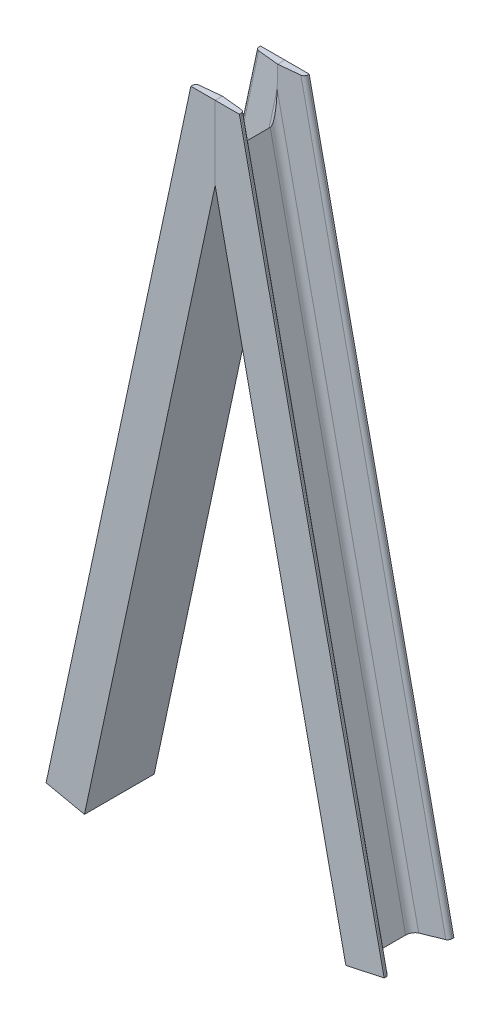
ISO-10303-21;
HEADER;
FILE_DESCRIPTION(('STEP AP214'),'2;1');
FILE_NAME('part.step','',(''),(''),'','','');
FILE_SCHEMA(('AUTOMOTIVE_DESIGN { 1 0 10303 214 1 1 1 1 }'));
ENDSEC;
DATA;
#1=APPLICATION_CONTEXT('core data for automotive mechanical design processes');
#2=APPLICATION_PROTOCOL_DEFINITION('international standard','automotive_design',2000,#1);
#3=PRODUCT_CONTEXT('',#1,'mechanical');
#4=PRODUCT('Part','Part','',(#3));
#5=PRODUCT_RELATED_PRODUCT_CATEGORY('part','',(#4));
#6=PRODUCT_DEFINITION_FORMATION('','',#4);
#7=PRODUCT_DEFINITION_CONTEXT('part definition',#1,'design');
#8=PRODUCT_DEFINITION('design','',#6,#7);
#9=PRODUCT_DEFINITION_SHAPE('','',#8);
#10=(LENGTH_UNIT() NAMED_UNIT(*) SI_UNIT(.MILLI.,.METRE.));
#11=(NAMED_UNIT(*) PLANE_ANGLE_UNIT() SI_UNIT($,.RADIAN.));
#12=(NAMED_UNIT(*) SI_UNIT($,.STERADIAN.) SOLID_ANGLE_UNIT());
#13=UNCERTAINTY_MEASURE_WITH_UNIT(LENGTH_MEASURE(1.E-05),#10,'distance_accuracy_value','');
#14=(GEOMETRIC_REPRESENTATION_CONTEXT(3) GLOBAL_UNCERTAINTY_ASSIGNED_CONTEXT((#13)) GLOBAL_UNIT_ASSIGNED_CONTEXT((#10,
#11,#12)) REPRESENTATION_CONTEXT('',''));
#15=CARTESIAN_POINT('',(0.,0.,0.));
#16=DIRECTION('',(0.,0.,1.));
#17=DIRECTION('',(1.,0.,0.));
#18=AXIS2_PLACEMENT_3D('',#15,#16,#17);
#19=CARTESIAN_POINT('',(-40.0898989771738,708.590692637966,78.1774248245681));
#20=DIRECTION('',(-0.209529088730874,-0.97780241407741,0.));
#21=DIRECTION('',(0.97780241407741,-0.209529088730874,0.));
#22=AXIS2_PLACEMENT_3D('',#19,#20,#21);
#23=CYLINDRICAL_SURFACE('',#22,4.);
#24=DIRECTION('',(-0.209529088730874,-0.97780241407741,0.));
#25=VECTOR('',#24,1.);
#26=CARTESIAN_POINT('',(-44.0011086334834,709.428808992889,78.1774248245681));
#27=LINE('',#26,#25);
#28=CARTESIAN_POINT('',(-27.8571428571429,784.767315949145,78.1774248245681));
#29=VERTEX_POINT('',#28);
#30=CARTESIAN_POINT('',(-194.001108633483,9.42880899288912,78.1774248245681));
#31=VERTEX_POINT('',#30);
#32=EDGE_CURVE('E218',#29,#31,#27,.T.);
#33=ORIENTED_EDGE('',*,*,#32,.F.);
#34=CARTESIAN_POINT('',(-23.7663368390639,784.767315949145,78.1774248245681));
#35=DIRECTION('',(0.,-1.,0.));
#36=DIRECTION('',(-1.,0.,0.));
#37=AXIS2_PLACEMENT_3D('',#34,#35,#36);
#38=ELLIPSE('',#37,4.09080601807896,4.);
#39=CARTESIAN_POINT('',(-24.1939425056598,784.767315949145,74.199337243095));
#40=VERTEX_POINT('',#39);
#41=EDGE_CURVE('E258',#29,#40,#38,.T.);
#42=ORIENTED_EDGE('',*,*,#41,.T.);
#43=DIRECTION('',(-0.209529088730874,-0.97780241407741,0.));
#44=VECTOR('',#43,1.);
#45=CARTESIAN_POINT('',(-40.4987317120654,708.678299652586,74.199337243095));
#46=LINE('',#45,#44);
#47=CARTESIAN_POINT('',(-190.498731712065,8.67829965258532,74.199337243095));
#48=VERTEX_POINT('',#47);
#49=EDGE_CURVE('E249',#40,#48,#46,.T.);
#50=ORIENTED_EDGE('',*,*,#49,.T.);
#51=CARTESIAN_POINT('',(-190.089898977174,8.59069263796563,78.1774248245681));
#52=DIRECTION('',(0.209529088730874,0.97780241407741,0.));
#53=DIRECTION('',(-0.97780241407741,0.209529088730874,0.));
#54=AXIS2_PLACEMENT_3D('',#51,#52,#53);
#55=CIRCLE('',#54,4.);
#56=EDGE_CURVE('E221',#48,#31,#55,.T.);
#57=ORIENTED_EDGE('',*,*,#56,.T.);
#58=EDGE_LOOP('',(#33,#42,#50,#57));
#59=FACE_BOUND('',#58,.T.);
#60=ADVANCED_FACE('F89',(#59),#23,.T.);
#61=CARTESIAN_POINT('',(-44.0011086334834,709.428808992889,80.));
#62=DIRECTION('',(0.97780241407741,-0.209529088730874,0.));
#63=DIRECTION('',(0.209529088730874,0.97780241407741,0.));
#64=AXIS2_PLACEMENT_3D('',#61,#62,#63);
#65=PLANE('',#64);
#66=DIRECTION('',(-0.209529088730874,-0.97780241407741,0.));
#67=VECTOR('',#66,1.);
#68=CARTESIAN_POINT('',(-44.0011086334834,709.428808992889,80.));
#69=LINE('',#68,#67);
#70=CARTESIAN_POINT('',(-27.8571428571429,784.767315949145,80.));
#71=VERTEX_POINT('',#70);
#72=CARTESIAN_POINT('',(-194.001108633483,9.42880899288912,80.));
#73=VERTEX_POINT('',#72);
#74=EDGE_CURVE('E222',#71,#73,#69,.T.);
#75=ORIENTED_EDGE('',*,*,#74,.F.);
#76=DIRECTION('',(0.,0.,-1.));
#77=VECTOR('',#76,1.);
#78=CARTESIAN_POINT('',(-27.8571428571429,784.767315949145,80.0000000000003));
#79=LINE('',#78,#77);
#80=EDGE_CURVE('E250',#71,#29,#79,.T.);
#81=ORIENTED_EDGE('',*,*,#80,.T.);
#82=ORIENTED_EDGE('',*,*,#32,.T.);
#83=DIRECTION('',(0.,0.,1.));
#84=VECTOR('',#83,1.);
#85=CARTESIAN_POINT('',(-194.001108633483,9.42880899288912,80.));
#86=LINE('',#85,#84);
#87=EDGE_CURVE('E220',#31,#73,#86,.T.);
#88=ORIENTED_EDGE('',*,*,#87,.T.);
#89=EDGE_LOOP('',(#75,#81,#82,#88));
#90=FACE_BOUND('',#89,.T.);
#91=ADVANCED_FACE('F329',(#90),#65,.F.);
#92=CARTESIAN_POINT('',(-44.0011086334834,709.428808992889,80.));
#93=DIRECTION('',(0.,0.,-1.));
#94=DIRECTION('',(-1.,0.,0.));
#95=AXIS2_PLACEMENT_3D('',#92,#93,#94);
#96=PLANE('',#95);
#97=DIRECTION('',(0.,-1.,0.));
#98=VECTOR('',#97,1.);
#99=CARTESIAN_POINT('',(0.,709.428808992889,80.));
#100=LINE('',#99,#98);
#101=CARTESIAN_POINT('',(0.,784.767315949145,80.));
#102=VERTEX_POINT('',#101);
#103=CARTESIAN_POINT('',(0.,700.,80.));
#104=VERTEX_POINT('',#103);
#105=EDGE_CURVE('E209',#102,#104,#100,.T.);
#106=ORIENTED_EDGE('',*,*,#105,.F.);
#107=DIRECTION('',(-1.,0.,0.));
#108=VECTOR('',#107,1.);
#109=CARTESIAN_POINT('',(121.963922393269,784.767315949145,80.));
#110=LINE('',#109,#108);
#111=EDGE_CURVE('E111',#102,#71,#110,.T.);
#112=ORIENTED_EDGE('',*,*,#111,.T.);
#113=ORIENTED_EDGE('',*,*,#74,.T.);
#114=DIRECTION('',(0.97780241407741,-0.209529088730874,0.));
#115=VECTOR('',#114,1.);
#116=CARTESIAN_POINT('',(-194.001108633483,9.42880899288912,80.));
#117=LINE('',#116,#115);
#118=CARTESIAN_POINT('',(-150.,-1.11022302462516E-13,80.));
#119=VERTEX_POINT('',#118);
#120=EDGE_CURVE('E224',#73,#119,#117,.T.);
#121=ORIENTED_EDGE('',*,*,#120,.T.);
#122=DIRECTION('',(-0.209529088730874,-0.97780241407741,0.));
#123=VECTOR('',#122,1.);
#124=CARTESIAN_POINT('',(0.,700.,80.));
#125=LINE('',#124,#123);
#126=EDGE_CURVE('E225',#104,#119,#125,.T.);
#127=ORIENTED_EDGE('',*,*,#126,.F.);
#128=EDGE_LOOP('',(#106,#112,#113,#121,#127));
#129=FACE_BOUND('',#128,.T.);
#130=ADVANCED_FACE('F327',(#129),#96,.F.);
#131=CARTESIAN_POINT('',(0.,700.,80.));
#132=DIRECTION('',(-0.97780241407741,0.209529088730874,0.));
#133=DIRECTION('',(-0.209529088730874,-0.97780241407741,0.));
#134=AXIS2_PLACEMENT_3D('',#131,#132,#133);
#135=PLANE('',#134);
#136=DIRECTION('',(0.,0.,-1.));
#137=VECTOR('',#136,1.);
#138=CARTESIAN_POINT('',(0.,700.,80.));
#139=LINE('',#138,#137);
#140=CARTESIAN_POINT('',(0.,700.,0.));
#141=VERTEX_POINT('',#140);
#142=EDGE_CURVE('E204',#104,#141,#139,.T.);
#143=ORIENTED_EDGE('',*,*,#142,.F.);
#144=ORIENTED_EDGE('',*,*,#126,.T.);
#145=DIRECTION('',(0.,0.,-1.));
#146=VECTOR('',#145,1.);
#147=CARTESIAN_POINT('',(-150.,-1.11022302462516E-13,80.));
#148=LINE('',#147,#146);
#149=CARTESIAN_POINT('',(-150.,-1.66533453693773E-13,0.));
#150=VERTEX_POINT('',#149);
#151=EDGE_CURVE('E227',#119,#150,#148,.T.);
#152=ORIENTED_EDGE('',*,*,#151,.T.);
#153=DIRECTION('',(-0.209529088730874,-0.97780241407741,0.));
#154=VECTOR('',#153,1.);
#155=CARTESIAN_POINT('',(0.,700.,0.));
#156=LINE('',#155,#154);
#157=EDGE_CURVE('E228',#141,#150,#156,.T.);
#158=ORIENTED_EDGE('',*,*,#157,.F.);
#159=EDGE_LOOP('',(#143,#144,#152,#158));
#160=FACE_BOUND('',#159,.T.);
#161=ADVANCED_FACE('F335',(#160),#135,.F.);
#162=CARTESIAN_POINT('',(-44.0011086334834,709.428808992889,0.));
#163=DIRECTION('',(0.,0.,1.));
#164=DIRECTION('',(1.,0.,0.));
#165=AXIS2_PLACEMENT_3D('',#162,#163,#164);
#166=PLANE('',#165);
#167=DIRECTION('',(-0.209529088730874,-0.97780241407741,0.));
#168=VECTOR('',#167,1.);
#169=CARTESIAN_POINT('',(-44.0011086334834,709.428808992889,0.));
#170=LINE('',#169,#168);
#171=CARTESIAN_POINT('',(-27.8571428571428,784.767315949145,0.));
#172=VERTEX_POINT('',#171);
#173=CARTESIAN_POINT('',(-194.001108633483,9.42880899288912,0.));
#174=VERTEX_POINT('',#173);
#175=EDGE_CURVE('E200',#172,#174,#170,.T.);
#176=ORIENTED_EDGE('',*,*,#175,.F.);
#177=DIRECTION('',(-1.,0.,0.));
#178=VECTOR('',#177,1.);
#179=CARTESIAN_POINT('',(121.963922393269,784.767315949145,0.));
#180=LINE('',#179,#178);
#181=CARTESIAN_POINT('',(0.,784.767315949145,0.));
#182=VERTEX_POINT('',#181);
#183=EDGE_CURVE('E188',#182,#172,#180,.T.);
#184=ORIENTED_EDGE('',*,*,#183,.F.);
#185=DIRECTION('',(0.,1.,0.));
#186=VECTOR('',#185,1.);
#187=CARTESIAN_POINT('',(0.,709.428808992889,0.));
#188=LINE('',#187,#186);
#189=EDGE_CURVE('E197',#141,#182,#188,.T.);
#190=ORIENTED_EDGE('',*,*,#189,.F.);
#191=ORIENTED_EDGE('',*,*,#157,.T.);
#192=DIRECTION('',(-0.97780241407741,0.209529088730874,0.));
#193=VECTOR('',#192,1.);
#194=CARTESIAN_POINT('',(-194.001108633483,9.42880899288912,0.));
#195=LINE('',#194,#193);
#196=EDGE_CURVE('E230',#150,#174,#195,.T.);
#197=ORIENTED_EDGE('',*,*,#196,.T.);
#198=EDGE_LOOP('',(#176,#184,#190,#191,#197));
#199=FACE_BOUND('',#198,.T.);
#200=ADVANCED_FACE('F196',(#199),#166,.F.);
#201=CARTESIAN_POINT('',(-44.0011086334834,709.428808992889,0.));
#202=DIRECTION('',(0.97780241407741,-0.209529088730874,0.));
#203=DIRECTION('',(0.209529088730874,0.97780241407741,0.));
#204=AXIS2_PLACEMENT_3D('',#201,#202,#203);
#205=PLANE('',#204);
#206=DIRECTION('',(-0.209529088730874,-0.97780241407741,0.));
#207=VECTOR('',#206,1.);
#208=CARTESIAN_POINT('',(-44.0011086334834,709.428808992889,1.82257517543191));
#209=LINE('',#208,#207);
#210=CARTESIAN_POINT('',(-27.8571428571429,784.767315949145,1.82257517543191));
#211=VERTEX_POINT('',#210);
#212=CARTESIAN_POINT('',(-194.001108633483,9.42880899288923,1.8225751754319));
#213=VERTEX_POINT('',#212);
#214=EDGE_CURVE('E233',#211,#213,#209,.T.);
#215=ORIENTED_EDGE('',*,*,#214,.F.);
#216=DIRECTION('',(0.,0.,-1.));
#217=VECTOR('',#216,1.);
#218=CARTESIAN_POINT('',(-27.8571428571429,784.767315949145,2.4980018054066E-13));
#219=LINE('',#218,#217);
#220=EDGE_CURVE('E319',#211,#172,#219,.T.);
#221=ORIENTED_EDGE('',*,*,#220,.T.);
#222=ORIENTED_EDGE('',*,*,#175,.T.);
#223=DIRECTION('',(0.,0.,1.));
#224=VECTOR('',#223,1.);
#225=CARTESIAN_POINT('',(-194.001108633483,9.42880899288912,0.));
#226=LINE('',#225,#224);
#227=EDGE_CURVE('E232',#174,#213,#226,.T.);
#228=ORIENTED_EDGE('',*,*,#227,.T.);
#229=EDGE_LOOP('',(#215,#221,#222,#228));
#230=FACE_BOUND('',#229,.T.);
#231=ADVANCED_FACE('F339',(#230),#205,.F.);
#232=CARTESIAN_POINT('',(-40.0898989771738,708.590692637966,1.82257517543191));
#233=DIRECTION('',(-0.209529088730874,-0.97780241407741,0.));
#234=DIRECTION('',(0.97780241407741,-0.209529088730874,0.));
#235=AXIS2_PLACEMENT_3D('',#232,#233,#234);
#236=CYLINDRICAL_SURFACE('',#235,4.00000000000002);
#237=DIRECTION('',(-0.209529088730874,-0.97780241407741,0.));
#238=VECTOR('',#237,1.);
#239=CARTESIAN_POINT('',(-40.4987317120654,708.678299652586,5.80066275690501));
#240=LINE('',#239,#238);
#241=CARTESIAN_POINT('',(-24.1939425056598,784.767315949145,5.80066275690499));
#242=VERTEX_POINT('',#241);
#243=CARTESIAN_POINT('',(-190.498731712066,8.67829965258532,5.80066275690501));
#244=VERTEX_POINT('',#243);
#245=EDGE_CURVE('E236',#242,#244,#240,.T.);
#246=ORIENTED_EDGE('',*,*,#245,.F.);
#247=CARTESIAN_POINT('',(-23.7663368390639,784.767315949145,1.82257517543191));
#248=DIRECTION('',(0.,-1.,0.));
#249=DIRECTION('',(-1.,0.,0.));
#250=AXIS2_PLACEMENT_3D('',#247,#248,#249);
#251=ELLIPSE('',#250,4.09080601807898,4.00000000000002);
#252=EDGE_CURVE('E320',#242,#211,#251,.T.);
#253=ORIENTED_EDGE('',*,*,#252,.T.);
#254=ORIENTED_EDGE('',*,*,#214,.T.);
#255=CARTESIAN_POINT('',(-190.089898977174,8.59069263796563,1.82257517543191));
#256=DIRECTION('',(0.209529088730874,0.97780241407741,0.));
#257=DIRECTION('',(0.97780241407741,-0.209529088730874,0.));
#258=AXIS2_PLACEMENT_3D('',#255,#256,#257);
#259=CIRCLE('',#258,4.00000000000002);
#260=EDGE_CURVE('E235',#213,#244,#259,.T.);
#261=ORIENTED_EDGE('',*,*,#260,.T.);
#262=EDGE_LOOP('',(#246,#253,#254,#261));
#263=FACE_BOUND('',#262,.T.);
#264=ADVANCED_FACE('F341',(#263),#236,.T.);
#265=CARTESIAN_POINT('',(-12.3826671202617,702.653428668628,8.82286583705383));
#266=DIRECTION('',(0.102208183722907,-0.0219017536549087,-0.994521895368274));
#267=DIRECTION('',(-0.994760510736495,0.,-0.102232706504666));
#268=AXIS2_PLACEMENT_3D('',#265,#266,#267);
#269=PLANE('',#268);
#270=DIRECTION('',(0.,-0.999757595235828,0.0220170563035927));
#271=VECTOR('',#270,1.);
#272=CARTESIAN_POINT('',(0.,702.681440369827,10.0948302015586));
#273=LINE('',#272,#271);
#274=CARTESIAN_POINT('',(0.,784.767315949145,8.28710265542954));
#275=VERTEX_POINT('',#274);
#276=CARTESIAN_POINT('',(0.,760.439208563183,8.82286583705381));
#277=VERTEX_POINT('',#276);
#278=EDGE_CURVE('E205',#275,#277,#273,.T.);
#279=ORIENTED_EDGE('',*,*,#278,.F.);
#280=DIRECTION('',(-0.994760510736494,0.,-0.102232706504666));
#281=VECTOR('',#280,1.);
#282=CARTESIAN_POINT('',(-12.1987638093749,784.767315949145,7.03342136552768));
#283=LINE('',#282,#281);
#284=EDGE_CURVE('E104',#275,#242,#283,.T.);
#285=ORIENTED_EDGE('',*,*,#284,.T.);
#286=ORIENTED_EDGE('',*,*,#245,.T.);
#287=DIRECTION('',(0.97244591014394,-0.208381266459416,0.104528463267647));
#288=VECTOR('',#287,1.);
#289=CARTESIAN_POINT('',(-162.382667120262,2.65342866862733,8.82286583705383));
#290=LINE('',#289,#288);
#291=CARTESIAN_POINT('',(-162.382667120262,2.65342866862733,8.82286583705382));
#292=VERTEX_POINT('',#291);
#293=EDGE_CURVE('E238',#244,#292,#290,.T.);
#294=ORIENTED_EDGE('',*,*,#293,.T.);
#295=DIRECTION('',(-0.209529088730874,-0.97780241407741,0.));
#296=VECTOR('',#295,1.);
#297=CARTESIAN_POINT('',(-12.3826671202617,702.653428668628,8.82286583705382));
#298=LINE('',#297,#296);
#299=EDGE_CURVE('E239',#277,#292,#298,.T.);
#300=ORIENTED_EDGE('',*,*,#299,.F.);
#301=EDGE_LOOP('',(#279,#285,#286,#294,#300));
#302=FACE_BOUND('',#301,.T.);
#303=ADVANCED_FACE('F298',(#302),#269,.F.);
#304=CARTESIAN_POINT('',(-13.2003325900451,702.828642697867,16.779041));
#305=DIRECTION('',(-0.209529088730874,-0.97780241407741,0.));
#306=DIRECTION('',(0.97780241407741,-0.209529088730874,0.));
#307=AXIS2_PLACEMENT_3D('',#304,#305,#306);
#308=CYLINDRICAL_SURFACE('',#307,8.00000000000001);
#309=CARTESIAN_POINT('',(0.,764.430194784744,16.779041));
#310=DIRECTION('',(1.,0.,0.));
#311=DIRECTION('',(0.,-1.,0.));
#312=AXIS2_PLACEMENT_3D('',#309,#310,#311);
#313=ELLIPSE('',#312,38.180856168737,8.00000000000001);
#314=CARTESIAN_POINT('',(0.,726.249338616007,16.779041));
#315=VERTEX_POINT('',#314);
#316=EDGE_CURVE('E207',#277,#315,#313,.F.);
#317=ORIENTED_EDGE('',*,*,#316,.F.);
#318=ORIENTED_EDGE('',*,*,#299,.T.);
#319=CARTESIAN_POINT('',(-163.200332590045,2.8286426978667,16.779041));
#320=DIRECTION('',(-0.209529088730874,-0.97780241407741,0.));
#321=DIRECTION('',(-0.97780241407741,0.209529088730874,0.));
#322=AXIS2_PLACEMENT_3D('',#319,#320,#321);
#323=CIRCLE('',#322,8.00000000000001);
#324=CARTESIAN_POINT('',(-155.377913277426,1.15240998801958,16.779041));
#325=VERTEX_POINT('',#324);
#326=EDGE_CURVE('E241',#292,#325,#323,.T.);
#327=ORIENTED_EDGE('',*,*,#326,.T.);
#328=DIRECTION('',(-0.209529088730874,-0.97780241407741,0.));
#329=VECTOR('',#328,1.);
#330=CARTESIAN_POINT('',(-5.37791327742576,701.15240998802,16.779041));
#331=LINE('',#330,#329);
#332=EDGE_CURVE('E242',#315,#325,#331,.T.);
#333=ORIENTED_EDGE('',*,*,#332,.F.);
#334=EDGE_LOOP('',(#317,#318,#327,#333));
#335=FACE_BOUND('',#334,.T.);
#336=ADVANCED_FACE('F296',(#335),#308,.F.);
#337=CARTESIAN_POINT('',(-5.37791327742575,701.15240998802,63.220959));
#338=DIRECTION('',(0.97780241407741,-0.209529088730874,0.));
#339=DIRECTION('',(0.209529088730874,0.97780241407741,0.));
#340=AXIS2_PLACEMENT_3D('',#337,#338,#339);
#341=PLANE('',#340);
#342=DIRECTION('',(0.,0.,1.));
#343=VECTOR('',#342,1.);
#344=CARTESIAN_POINT('',(0.,726.249338616007,63.220959));
#345=LINE('',#344,#343);
#346=CARTESIAN_POINT('',(0.,726.249338616007,63.220959));
#347=VERTEX_POINT('',#346);
#348=EDGE_CURVE('E289',#315,#347,#345,.T.);
#349=ORIENTED_EDGE('',*,*,#348,.F.);
#350=ORIENTED_EDGE('',*,*,#332,.T.);
#351=DIRECTION('',(0.,0.,1.));
#352=VECTOR('',#351,1.);
#353=CARTESIAN_POINT('',(-155.377913277426,1.15240998801963,63.220959));
#354=LINE('',#353,#352);
#355=CARTESIAN_POINT('',(-155.377913277426,1.15240998801963,63.220959));
#356=VERTEX_POINT('',#355);
#357=EDGE_CURVE('E244',#325,#356,#354,.T.);
#358=ORIENTED_EDGE('',*,*,#357,.T.);
#359=DIRECTION('',(-0.209529088730874,-0.97780241407741,0.));
#360=VECTOR('',#359,1.);
#361=CARTESIAN_POINT('',(-5.37791327742575,701.15240998802,63.220959));
#362=LINE('',#361,#360);
#363=EDGE_CURVE('E245',#347,#356,#362,.T.);
#364=ORIENTED_EDGE('',*,*,#363,.F.);
#365=EDGE_LOOP('',(#349,#350,#358,#364));
#366=FACE_BOUND('',#365,.T.);
#367=ADVANCED_FACE('F311',(#366),#341,.F.);
#368=CARTESIAN_POINT('',(-13.200332590045,702.828642697867,63.220959));
#369=DIRECTION('',(-0.209529088730874,-0.97780241407741,0.));
#370=DIRECTION('',(0.97780241407741,-0.209529088730874,0.));
#371=AXIS2_PLACEMENT_3D('',#368,#369,#370);
#372=CYLINDRICAL_SURFACE('',#371,7.99999999999999);
#373=CARTESIAN_POINT('',(0.,764.430194784744,63.220959));
#374=DIRECTION('',(1.,0.,0.));
#375=DIRECTION('',(0.,-1.,0.));
#376=AXIS2_PLACEMENT_3D('',#373,#374,#375);
#377=ELLIPSE('',#376,38.1808561687369,7.99999999999999);
#378=CARTESIAN_POINT('',(0.,760.439208563183,71.1771341629462));
#379=VERTEX_POINT('',#378);
#380=EDGE_CURVE('E193',#347,#379,#377,.F.);
#381=ORIENTED_EDGE('',*,*,#380,.F.);
#382=ORIENTED_EDGE('',*,*,#363,.T.);
#383=CARTESIAN_POINT('',(-163.200332590045,2.82864269786665,63.220959));
#384=DIRECTION('',(-0.209529088730874,-0.97780241407741,0.));
#385=DIRECTION('',(0.97780241407741,-0.209529088730874,0.));
#386=AXIS2_PLACEMENT_3D('',#383,#384,#385);
#387=CIRCLE('',#386,7.99999999999999);
#388=CARTESIAN_POINT('',(-162.382667120262,2.65342866862739,71.1771341629462));
#389=VERTEX_POINT('',#388);
#390=EDGE_CURVE('E247',#356,#389,#387,.T.);
#391=ORIENTED_EDGE('',*,*,#390,.T.);
#392=DIRECTION('',(-0.209529088730874,-0.97780241407741,0.));
#393=VECTOR('',#392,1.);
#394=CARTESIAN_POINT('',(-12.3826671202617,702.653428668628,71.1771341629462));
#395=LINE('',#394,#393);
#396=EDGE_CURVE('E248',#379,#389,#395,.T.);
#397=ORIENTED_EDGE('',*,*,#396,.F.);
#398=EDGE_LOOP('',(#381,#382,#391,#397));
#399=FACE_BOUND('',#398,.T.);
#400=ADVANCED_FACE('F313',(#399),#372,.F.);
#401=CARTESIAN_POINT('',(-12.3826671202617,702.653428668628,71.1771341629462));
#402=DIRECTION('',(0.102208183722907,-0.0219017536549087,0.994521895368274));
#403=DIRECTION('',(0.994760510736495,0.,-0.102232706504666));
#404=AXIS2_PLACEMENT_3D('',#401,#402,#403);
#405=PLANE('',#404);
#406=ORIENTED_EDGE('',*,*,#49,.F.);
#407=DIRECTION('',(0.994760510736494,0.,-0.102232706504666));
#408=VECTOR('',#407,1.);
#409=CARTESIAN_POINT('',(-12.1987638093749,784.767315949145,72.9665786344723));
#410=LINE('',#409,#408);
#411=CARTESIAN_POINT('',(0.,784.767315949145,71.7128973445705));
#412=VERTEX_POINT('',#411);
#413=EDGE_CURVE('E263',#40,#412,#410,.T.);
#414=ORIENTED_EDGE('',*,*,#413,.T.);
#415=DIRECTION('',(0.,0.999757595235828,0.0220170563035926));
#416=VECTOR('',#415,1.);
#417=CARTESIAN_POINT('',(0.,702.681440369827,69.9051697984414));
#418=LINE('',#417,#416);
#419=EDGE_CURVE('E214',#379,#412,#418,.T.);
#420=ORIENTED_EDGE('',*,*,#419,.F.);
#421=ORIENTED_EDGE('',*,*,#396,.T.);
#422=DIRECTION('',(-0.97244591014394,0.208381266459416,0.104528463267647));
#423=VECTOR('',#422,1.);
#424=CARTESIAN_POINT('',(-162.382667120262,2.65342866862739,71.1771341629462));
#425=LINE('',#424,#423);
#426=EDGE_CURVE('E217',#389,#48,#425,.T.);
#427=ORIENTED_EDGE('',*,*,#426,.T.);
#428=EDGE_LOOP('',(#406,#414,#420,#421,#427));
#429=FACE_BOUND('',#428,.T.);
#430=ADVANCED_FACE('F318',(#429),#405,.F.);
#431=CARTESIAN_POINT('',(-190.089898977174,8.59069263796563,78.1774248245681));
#432=DIRECTION('',(0.209529088730874,0.97780241407741,0.));
#433=DIRECTION('',(-0.97780241407741,0.209529088730874,0.));
#434=AXIS2_PLACEMENT_3D('',#431,#432,#433);
#435=PLANE('',#434);
#436=ORIENTED_EDGE('',*,*,#56,.F.);
#437=ORIENTED_EDGE('',*,*,#426,.F.);
#438=ORIENTED_EDGE('',*,*,#390,.F.);
#439=ORIENTED_EDGE('',*,*,#357,.F.);
#440=ORIENTED_EDGE('',*,*,#326,.F.);
#441=ORIENTED_EDGE('',*,*,#293,.F.);
#442=ORIENTED_EDGE('',*,*,#260,.F.);
#443=ORIENTED_EDGE('',*,*,#227,.F.);
#444=ORIENTED_EDGE('',*,*,#196,.F.);
#445=ORIENTED_EDGE('',*,*,#151,.F.);
#446=ORIENTED_EDGE('',*,*,#120,.F.);
#447=ORIENTED_EDGE('',*,*,#87,.F.);
#448=EDGE_LOOP('',(#436,#437,#438,#439,#440,#441,#442,#443,#444,#445,#446,#447));
#449=FACE_BOUND('',#448,.T.);
#450=ADVANCED_FACE('F306',(#449),#435,.F.);
#451=CARTESIAN_POINT('',(0.,700.,0.));
#452=DIRECTION('',(1.,0.,0.));
#453=DIRECTION('',(0.,0.,-1.));
#454=AXIS2_PLACEMENT_3D('',#451,#452,#453);
#455=PLANE('',#454);
#456=DIRECTION('',(0.,0.,-1.));
#457=VECTOR('',#456,1.);
#458=CARTESIAN_POINT('',(0.,784.767315949145,0.));
#459=LINE('',#458,#457);
#460=EDGE_CURVE('E14',#102,#412,#459,.T.);
#461=ORIENTED_EDGE('',*,*,#460,.F.);
#462=ORIENTED_EDGE('',*,*,#105,.T.);
#463=ORIENTED_EDGE('',*,*,#142,.T.);
#464=ORIENTED_EDGE('',*,*,#189,.T.);
#465=EDGE_CURVE('E93',#275,#182,#459,.T.);
#466=ORIENTED_EDGE('',*,*,#465,.F.);
#467=ORIENTED_EDGE('',*,*,#278,.T.);
#468=ORIENTED_EDGE('',*,*,#316,.T.);
#469=ORIENTED_EDGE('',*,*,#348,.T.);
#470=ORIENTED_EDGE('',*,*,#380,.T.);
#471=ORIENTED_EDGE('',*,*,#419,.T.);
#472=EDGE_LOOP('',(#461,#462,#463,#464,#466,#467,#468,#469,#470,#471));
#473=FACE_BOUND('',#472,.T.);
#474=ADVANCED_FACE('F91',(#473),#455,.T.);
#475=CARTESIAN_POINT('',(121.963922393269,784.767315949145,80.));
#476=DIRECTION('',(0.,-1.,0.));
#477=DIRECTION('',(0.,0.,-1.));
#478=AXIS2_PLACEMENT_3D('',#475,#476,#477);
#479=PLANE('',#478);
#480=ORIENTED_EDGE('',*,*,#252,.F.);
#481=ORIENTED_EDGE('',*,*,#284,.F.);
#482=ORIENTED_EDGE('',*,*,#465,.T.);
#483=ORIENTED_EDGE('',*,*,#183,.T.);
#484=ORIENTED_EDGE('',*,*,#220,.F.);
#485=EDGE_LOOP('',(#480,#481,#482,#483,#484));
#486=FACE_BOUND('',#485,.T.);
#487=ADVANCED_FACE('F187',(#486),#479,.F.);
#488=ORIENTED_EDGE('',*,*,#111,.F.);
#489=ORIENTED_EDGE('',*,*,#460,.T.);
#490=ORIENTED_EDGE('',*,*,#413,.F.);
#491=ORIENTED_EDGE('',*,*,#41,.F.);
#492=ORIENTED_EDGE('',*,*,#80,.F.);
#493=EDGE_LOOP('',(#488,#489,#490,#491,#492));
#494=FACE_BOUND('',#493,.T.);
#495=ADVANCED_FACE('F444',(#494),#479,.F.);
#496=CLOSED_SHELL('',(#60,#91,#130,#161,#200,#231,#264,#303,#336,#367,#400,#430,#450,#474,#487,#495));
#497=MANIFOLD_SOLID_BREP('B2',#496);
#498=CARTESIAN_POINT('',(190.089898977174,8.59069263796563,78.1774248245681));
#499=DIRECTION('',(-0.209529088730874,0.97780241407741,0.));
#500=DIRECTION('',(-0.97780241407741,-0.209529088730873,0.));
#501=AXIS2_PLACEMENT_3D('',#498,#499,#500);
#502=CYLINDRICAL_SURFACE('',#501,4.);
#503=DIRECTION('',(-0.209529088730874,0.97780241407741,0.));
#504=VECTOR('',#503,1.);
#505=CARTESIAN_POINT('',(190.498731712065,8.67829965258521,74.199337243095));
#506=LINE('',#505,#504);
#507=CARTESIAN_POINT('',(190.498731712065,8.67829965258521,74.199337243095));
#508=VERTEX_POINT('',#507);
#509=CARTESIAN_POINT('',(24.1939425056597,784.767315949145,74.199337243095));
#510=VERTEX_POINT('',#509);
#511=EDGE_CURVE('E620',#508,#510,#506,.T.);
#512=ORIENTED_EDGE('',*,*,#511,.T.);
#513=CARTESIAN_POINT('',(23.7663368390639,784.767315949145,78.1774248245681));
#514=DIRECTION('',(0.,-1.,0.));
#515=DIRECTION('',(-1.,0.,0.));
#516=AXIS2_PLACEMENT_3D('',#513,#514,#515);
#517=ELLIPSE('',#516,4.09080601807896,4.);
#518=CARTESIAN_POINT('',(27.8571428571428,784.767315949145,78.1774248245681));
#519=VERTEX_POINT('',#518);
#520=EDGE_CURVE('E733',#510,#519,#517,.T.);
#521=ORIENTED_EDGE('',*,*,#520,.T.);
#522=DIRECTION('',(-0.209529088730874,0.97780241407741,0.));
#523=VECTOR('',#522,1.);
#524=CARTESIAN_POINT('',(194.001108633483,9.42880899288917,78.1774248245681));
#525=LINE('',#524,#523);
#526=CARTESIAN_POINT('',(194.001108633483,9.42880899288917,78.1774248245681));
#527=VERTEX_POINT('',#526);
#528=EDGE_CURVE('E659',#527,#519,#525,.T.);
#529=ORIENTED_EDGE('',*,*,#528,.F.);
#530=CARTESIAN_POINT('',(190.089898977174,8.59069263796563,78.1774248245681));
#531=DIRECTION('',(0.209529088730874,-0.97780241407741,0.));
#532=DIRECTION('',(0.97780241407741,0.209529088730873,0.));
#533=AXIS2_PLACEMENT_3D('',#530,#531,#532);
#534=CIRCLE('',#533,4.);
#535=EDGE_CURVE('E657',#508,#527,#534,.T.);
#536=ORIENTED_EDGE('',*,*,#535,.F.);
#537=EDGE_LOOP('',(#512,#521,#529,#536));
#538=FACE_BOUND('',#537,.T.);
#539=ADVANCED_FACE('F514',(#538),#502,.T.);
#540=CARTESIAN_POINT('',(194.001108633483,9.42880899288912,80.));
#541=DIRECTION('',(-0.97780241407741,-0.209529088730873,0.));
#542=DIRECTION('',(0.209529088730874,-0.97780241407741,0.));
#543=AXIS2_PLACEMENT_3D('',#540,#541,#542);
#544=PLANE('',#543);
#545=ORIENTED_EDGE('',*,*,#528,.T.);
#546=DIRECTION('',(0.,0.,1.));
#547=VECTOR('',#546,1.);
#548=CARTESIAN_POINT('',(27.8571428571428,784.767315949145,80.0000000000026));
#549=LINE('',#548,#547);
#550=CARTESIAN_POINT('',(27.8571428571428,784.767315949145,80.));
#551=VERTEX_POINT('',#550);
#552=EDGE_CURVE('E734',#519,#551,#549,.T.);
#553=ORIENTED_EDGE('',*,*,#552,.T.);
#554=DIRECTION('',(-0.209529088730874,0.97780241407741,0.));
#555=VECTOR('',#554,1.);
#556=CARTESIAN_POINT('',(194.001108633483,9.42880899288912,80.));
#557=LINE('',#556,#555);
#558=CARTESIAN_POINT('',(194.001108633483,9.42880899288912,80.));
#559=VERTEX_POINT('',#558);
#560=EDGE_CURVE('E665',#559,#551,#557,.T.);
#561=ORIENTED_EDGE('',*,*,#560,.F.);
#562=DIRECTION('',(0.,0.,1.));
#563=VECTOR('',#562,1.);
#564=CARTESIAN_POINT('',(194.001108633483,9.42880899288912,80.));
#565=LINE('',#564,#563);
#566=EDGE_CURVE('E730',#527,#559,#565,.T.);
#567=ORIENTED_EDGE('',*,*,#566,.F.);
#568=EDGE_LOOP('',(#545,#553,#561,#567));
#569=FACE_BOUND('',#568,.T.);
#570=ADVANCED_FACE('F753',(#569),#544,.F.);
#571=CARTESIAN_POINT('',(194.001108633483,9.42880899288912,80.));
#572=DIRECTION('',(0.,0.,-1.));
#573=DIRECTION('',(-1.,0.,0.));
#574=AXIS2_PLACEMENT_3D('',#571,#572,#573);
#575=PLANE('',#574);
#576=ORIENTED_EDGE('',*,*,#560,.T.);
#577=DIRECTION('',(-1.,0.,0.));
#578=VECTOR('',#577,1.);
#579=CARTESIAN_POINT('',(121.963922393269,784.767315949145,80.));
#580=LINE('',#579,#578);
#581=CARTESIAN_POINT('',(0.,784.767315949145,80.));
#582=VERTEX_POINT('',#581);
#583=EDGE_CURVE('E631',#551,#582,#580,.T.);
#584=ORIENTED_EDGE('',*,*,#583,.T.);
#585=DIRECTION('',(0.,1.,0.));
#586=VECTOR('',#585,1.);
#587=CARTESIAN_POINT('',(0.,9.42880899288906,79.9999999999999));
#588=LINE('',#587,#586);
#589=CARTESIAN_POINT('',(0.,700.,80.));
#590=VERTEX_POINT('',#589);
#591=EDGE_CURVE('E689',#590,#582,#588,.T.);
#592=ORIENTED_EDGE('',*,*,#591,.F.);
#593=DIRECTION('',(-0.209529088730874,0.97780241407741,0.));
#594=VECTOR('',#593,1.);
#595=CARTESIAN_POINT('',(150.,-1.66533453693773E-13,80.));
#596=LINE('',#595,#594);
#597=CARTESIAN_POINT('',(150.,-1.66533453693773E-13,80.));
#598=VERTEX_POINT('',#597);
#599=EDGE_CURVE('E640',#598,#590,#596,.T.);
#600=ORIENTED_EDGE('',*,*,#599,.F.);
#601=DIRECTION('',(-0.97780241407741,-0.209529088730874,0.));
#602=VECTOR('',#601,1.);
#603=CARTESIAN_POINT('',(194.001108633483,9.42880899288912,80.));
#604=LINE('',#603,#602);
#605=EDGE_CURVE('E728',#559,#598,#604,.T.);
#606=ORIENTED_EDGE('',*,*,#605,.F.);
#607=EDGE_LOOP('',(#576,#584,#592,#600,#606));
#608=FACE_BOUND('',#607,.T.);
#609=ADVANCED_FACE('F751',(#608),#575,.F.);
#610=CARTESIAN_POINT('',(150.,-1.66533453693773E-13,80.));
#611=DIRECTION('',(0.97780241407741,0.209529088730873,0.));
#612=DIRECTION('',(-0.209529088730874,0.97780241407741,0.));
#613=AXIS2_PLACEMENT_3D('',#610,#611,#612);
#614=PLANE('',#613);
#615=DIRECTION('',(0.,0.,1.));
#616=VECTOR('',#615,1.);
#617=CARTESIAN_POINT('',(0.,700.,80.));
#618=LINE('',#617,#616);
#619=CARTESIAN_POINT('',(0.,700.,0.));
#620=VERTEX_POINT('',#619);
#621=EDGE_CURVE('E683',#620,#590,#618,.T.);
#622=ORIENTED_EDGE('',*,*,#621,.F.);
#623=DIRECTION('',(-0.209529088730874,0.97780241407741,0.));
#624=VECTOR('',#623,1.);
#625=CARTESIAN_POINT('',(150.,-1.66533453693773E-13,0.));
#626=LINE('',#625,#624);
#627=CARTESIAN_POINT('',(150.,-1.66533453693773E-13,0.));
#628=VERTEX_POINT('',#627);
#629=EDGE_CURVE('E636',#628,#620,#626,.T.);
#630=ORIENTED_EDGE('',*,*,#629,.F.);
#631=DIRECTION('',(0.,0.,-1.));
#632=VECTOR('',#631,1.);
#633=CARTESIAN_POINT('',(150.,-1.66533453693773E-13,80.));
#634=LINE('',#633,#632);
#635=EDGE_CURVE('E684',#598,#628,#634,.T.);
#636=ORIENTED_EDGE('',*,*,#635,.F.);
#637=ORIENTED_EDGE('',*,*,#599,.T.);
#638=EDGE_LOOP('',(#622,#630,#636,#637));
#639=FACE_BOUND('',#638,.T.);
#640=ADVANCED_FACE('F681',(#639),#614,.F.);
#641=CARTESIAN_POINT('',(194.001108633483,9.42880899288912,0.));
#642=DIRECTION('',(0.,0.,1.));
#643=DIRECTION('',(1.,0.,0.));
#644=AXIS2_PLACEMENT_3D('',#641,#642,#643);
#645=PLANE('',#644);
#646=DIRECTION('',(0.,-1.,0.));
#647=VECTOR('',#646,1.);
#648=CARTESIAN_POINT('',(0.,9.42880899288912,0.));
#649=LINE('',#648,#647);
#650=CARTESIAN_POINT('',(0.,784.767315949146,0.));
#651=VERTEX_POINT('',#650);
#652=EDGE_CURVE('E630',#651,#620,#649,.T.);
#653=ORIENTED_EDGE('',*,*,#652,.F.);
#654=DIRECTION('',(-1.,0.,0.));
#655=VECTOR('',#654,1.);
#656=CARTESIAN_POINT('',(121.963922393269,784.767315949145,0.));
#657=LINE('',#656,#655);
#658=CARTESIAN_POINT('',(27.8571428571427,784.767315949145,0.));
#659=VERTEX_POINT('',#658);
#660=EDGE_CURVE('E528',#659,#651,#657,.T.);
#661=ORIENTED_EDGE('',*,*,#660,.F.);
#662=DIRECTION('',(-0.209529088730874,0.97780241407741,0.));
#663=VECTOR('',#662,1.);
#664=CARTESIAN_POINT('',(194.001108633483,9.42880899288912,0.));
#665=LINE('',#664,#663);
#666=CARTESIAN_POINT('',(194.001108633483,9.42880899288912,0.));
#667=VERTEX_POINT('',#666);
#668=EDGE_CURVE('E627',#667,#659,#665,.T.);
#669=ORIENTED_EDGE('',*,*,#668,.F.);
#670=DIRECTION('',(0.977802414077409,0.209529088730873,0.));
#671=VECTOR('',#670,1.);
#672=CARTESIAN_POINT('',(194.001108633483,9.42880899288912,0.));
#673=LINE('',#672,#671);
#674=EDGE_CURVE('E725',#628,#667,#673,.T.);
#675=ORIENTED_EDGE('',*,*,#674,.F.);
#676=ORIENTED_EDGE('',*,*,#629,.T.);
#677=EDGE_LOOP('',(#653,#661,#669,#675,#676));
#678=FACE_BOUND('',#677,.T.);
#679=ADVANCED_FACE('F625',(#678),#645,.F.);
#680=CARTESIAN_POINT('',(194.001108633483,9.42880899288912,0.));
#681=DIRECTION('',(-0.97780241407741,-0.209529088730873,0.));
#682=DIRECTION('',(0.209529088730874,-0.97780241407741,0.));
#683=AXIS2_PLACEMENT_3D('',#680,#681,#682);
#684=PLANE('',#683);
#685=ORIENTED_EDGE('',*,*,#668,.T.);
#686=DIRECTION('',(0.,0.,1.));
#687=VECTOR('',#686,1.);
#688=CARTESIAN_POINT('',(27.8571428571428,784.767315949145,2.56739074444567E-12));
#689=LINE('',#688,#687);
#690=CARTESIAN_POINT('',(27.8571428571428,784.767315949145,1.8225751754319));
#691=VERTEX_POINT('',#690);
#692=EDGE_CURVE('E612',#659,#691,#689,.T.);
#693=ORIENTED_EDGE('',*,*,#692,.T.);
#694=DIRECTION('',(-0.209529088730874,0.97780241407741,0.));
#695=VECTOR('',#694,1.);
#696=CARTESIAN_POINT('',(194.001108633483,9.42880899288917,1.82257517543191));
#697=LINE('',#696,#695);
#698=CARTESIAN_POINT('',(194.001108633483,9.42880899288917,1.82257517543191));
#699=VERTEX_POINT('',#698);
#700=EDGE_CURVE('E635',#699,#691,#697,.T.);
#701=ORIENTED_EDGE('',*,*,#700,.F.);
#702=DIRECTION('',(0.,0.,1.));
#703=VECTOR('',#702,1.);
#704=CARTESIAN_POINT('',(194.001108633483,9.42880899288912,0.));
#705=LINE('',#704,#703);
#706=EDGE_CURVE('E634',#667,#699,#705,.T.);
#707=ORIENTED_EDGE('',*,*,#706,.F.);
#708=EDGE_LOOP('',(#685,#693,#701,#707));
#709=FACE_BOUND('',#708,.T.);
#710=ADVANCED_FACE('F633',(#709),#684,.F.);
#711=CARTESIAN_POINT('',(190.089898977174,8.59069263796569,1.82257517543191));
#712=DIRECTION('',(-0.209529088730874,0.97780241407741,0.));
#713=DIRECTION('',(-0.97780241407741,-0.209529088730873,0.));
#714=AXIS2_PLACEMENT_3D('',#711,#712,#713);
#715=CYLINDRICAL_SURFACE('',#714,4.00000000000002);
#716=ORIENTED_EDGE('',*,*,#700,.T.);
#717=CARTESIAN_POINT('',(23.7663368390639,784.767315949145,1.8225751754319));
#718=DIRECTION('',(0.,-1.,0.));
#719=DIRECTION('',(-1.,0.,0.));
#720=AXIS2_PLACEMENT_3D('',#717,#718,#719);
#721=ELLIPSE('',#720,4.09080601807898,4.00000000000002);
#722=CARTESIAN_POINT('',(24.1939425056598,784.767315949145,5.80066275690499));
#723=VERTEX_POINT('',#722);
#724=EDGE_CURVE('E615',#691,#723,#721,.T.);
#725=ORIENTED_EDGE('',*,*,#724,.T.);
#726=DIRECTION('',(-0.209529088730874,0.97780241407741,0.));
#727=VECTOR('',#726,1.);
#728=CARTESIAN_POINT('',(190.498731712065,8.67829965258526,5.800662756905));
#729=LINE('',#728,#727);
#730=CARTESIAN_POINT('',(190.498731712065,8.67829965258526,5.800662756905));
#731=VERTEX_POINT('',#730);
#732=EDGE_CURVE('E638',#731,#723,#729,.T.);
#733=ORIENTED_EDGE('',*,*,#732,.F.);
#734=CARTESIAN_POINT('',(190.089898977174,8.59069263796569,1.82257517543191));
#735=DIRECTION('',(0.209529088730874,-0.97780241407741,0.));
#736=DIRECTION('',(-0.97780241407741,-0.209529088730873,0.));
#737=AXIS2_PLACEMENT_3D('',#734,#735,#736);
#738=CIRCLE('',#737,4.00000000000002);
#739=EDGE_CURVE('E722',#699,#731,#738,.T.);
#740=ORIENTED_EDGE('',*,*,#739,.F.);
#741=EDGE_LOOP('',(#716,#725,#733,#740));
#742=FACE_BOUND('',#741,.T.);
#743=ADVANCED_FACE('F743',(#742),#715,.T.);
#744=CARTESIAN_POINT('',(162.382667120262,2.65342866862739,8.82286583705381));
#745=DIRECTION('',(-0.102208183722907,-0.0219017536549087,-0.994521895368274));
#746=DIRECTION('',(-0.994760510736495,0.,0.102232706504666));
#747=AXIS2_PLACEMENT_3D('',#744,#745,#746);
#748=PLANE('',#747);
#749=ORIENTED_EDGE('',*,*,#732,.T.);
#750=DIRECTION('',(-0.994760510736494,0.,0.102232706504665));
#751=VECTOR('',#750,1.);
#752=CARTESIAN_POINT('',(160.631034867485,784.767315949145,-8.22113753495561));
#753=LINE('',#752,#751);
#754=CARTESIAN_POINT('',(0.,784.767315949145,8.28710265542955));
#755=VERTEX_POINT('',#754);
#756=EDGE_CURVE('E736',#723,#755,#753,.T.);
#757=ORIENTED_EDGE('',*,*,#756,.T.);
#758=DIRECTION('',(0.,0.999757595235828,-0.0220170563035927));
#759=VECTOR('',#758,1.);
#760=CARTESIAN_POINT('',(0.,3.02076590761957,25.5030336865347));
#761=LINE('',#760,#759);
#762=CARTESIAN_POINT('',(0.,760.439208563183,8.82286583705381));
#763=VERTEX_POINT('',#762);
#764=EDGE_CURVE('E692',#763,#755,#761,.T.);
#765=ORIENTED_EDGE('',*,*,#764,.F.);
#766=DIRECTION('',(-0.209529088730874,0.97780241407741,0.));
#767=VECTOR('',#766,1.);
#768=CARTESIAN_POINT('',(162.382667120262,2.65342866862739,8.82286583705381));
#769=LINE('',#768,#767);
#770=CARTESIAN_POINT('',(162.382667120262,2.65342866862739,8.82286583705381));
#771=VERTEX_POINT('',#770);
#772=EDGE_CURVE('E646',#771,#763,#769,.T.);
#773=ORIENTED_EDGE('',*,*,#772,.F.);
#774=DIRECTION('',(-0.972445910143939,-0.208381266459416,0.104528463267647));
#775=VECTOR('',#774,1.);
#776=CARTESIAN_POINT('',(162.382667120262,2.65342866862739,8.82286583705381));
#777=LINE('',#776,#775);
#778=EDGE_CURVE('E720',#731,#771,#777,.T.);
#779=ORIENTED_EDGE('',*,*,#778,.F.);
#780=EDGE_LOOP('',(#749,#757,#765,#773,#779));
#781=FACE_BOUND('',#780,.T.);
#782=ADVANCED_FACE('F747',(#781),#748,.F.);
#783=CARTESIAN_POINT('',(163.200332590045,2.82864269786665,16.779041));
#784=DIRECTION('',(-0.209529088730874,0.97780241407741,0.));
#785=DIRECTION('',(-0.97780241407741,-0.209529088730873,0.));
#786=AXIS2_PLACEMENT_3D('',#783,#784,#785);
#787=CYLINDRICAL_SURFACE('',#786,8.00000000000001);
#788=CARTESIAN_POINT('',(0.,764.430194784744,16.779041));
#789=DIRECTION('',(-1.,0.,0.));
#790=DIRECTION('',(0.,1.,0.));
#791=AXIS2_PLACEMENT_3D('',#788,#789,#790);
#792=ELLIPSE('',#791,38.180856168737,8.00000000000001);
#793=CARTESIAN_POINT('',(0.,726.249338616007,16.779041));
#794=VERTEX_POINT('',#793);
#795=EDGE_CURVE('E698',#794,#763,#792,.F.);
#796=ORIENTED_EDGE('',*,*,#795,.F.);
#797=DIRECTION('',(-0.209529088730874,0.97780241407741,0.));
#798=VECTOR('',#797,1.);
#799=CARTESIAN_POINT('',(155.377913277426,1.15240998801963,16.779041));
#800=LINE('',#799,#798);
#801=CARTESIAN_POINT('',(155.377913277426,1.15240998801963,16.779041));
#802=VERTEX_POINT('',#801);
#803=EDGE_CURVE('E649',#802,#794,#800,.T.);
#804=ORIENTED_EDGE('',*,*,#803,.F.);
#805=CARTESIAN_POINT('',(163.200332590045,2.82864269786665,16.779041));
#806=DIRECTION('',(-0.209529088730874,0.97780241407741,0.));
#807=DIRECTION('',(0.97780241407741,0.209529088730873,0.));
#808=AXIS2_PLACEMENT_3D('',#805,#806,#807);
#809=CIRCLE('',#808,8.00000000000001);
#810=EDGE_CURVE('E718',#771,#802,#809,.T.);
#811=ORIENTED_EDGE('',*,*,#810,.F.);
#812=ORIENTED_EDGE('',*,*,#772,.T.);
#813=EDGE_LOOP('',(#796,#804,#811,#812));
#814=FACE_BOUND('',#813,.T.);
#815=ADVANCED_FACE('F767',(#814),#787,.F.);
#816=CARTESIAN_POINT('',(155.377913277426,1.15240998801969,63.220959));
#817=DIRECTION('',(-0.97780241407741,-0.209529088730873,0.));
#818=DIRECTION('',(0.209529088730874,-0.97780241407741,0.));
#819=AXIS2_PLACEMENT_3D('',#816,#817,#818);
#820=PLANE('',#819);
#821=DIRECTION('',(0.,0.,-1.));
#822=VECTOR('',#821,1.);
#823=CARTESIAN_POINT('',(0.,726.249338616007,63.220959));
#824=LINE('',#823,#822);
#825=CARTESIAN_POINT('',(0.,726.249338616007,63.220959));
#826=VERTEX_POINT('',#825);
#827=EDGE_CURVE('E701',#826,#794,#824,.T.);
#828=ORIENTED_EDGE('',*,*,#827,.F.);
#829=DIRECTION('',(-0.209529088730874,0.97780241407741,0.));
#830=VECTOR('',#829,1.);
#831=CARTESIAN_POINT('',(155.377913277426,1.15240998801969,63.220959));
#832=LINE('',#831,#830);
#833=CARTESIAN_POINT('',(155.377913277426,1.15240998801969,63.220959));
#834=VERTEX_POINT('',#833);
#835=EDGE_CURVE('E652',#834,#826,#832,.T.);
#836=ORIENTED_EDGE('',*,*,#835,.F.);
#837=DIRECTION('',(0.,0.,1.));
#838=VECTOR('',#837,1.);
#839=CARTESIAN_POINT('',(155.377913277426,1.15240998801969,63.220959));
#840=LINE('',#839,#838);
#841=EDGE_CURVE('E713',#802,#834,#840,.T.);
#842=ORIENTED_EDGE('',*,*,#841,.F.);
#843=ORIENTED_EDGE('',*,*,#803,.T.);
#844=EDGE_LOOP('',(#828,#836,#842,#843));
#845=FACE_BOUND('',#844,.T.);
#846=ADVANCED_FACE('F765',(#845),#820,.F.);
#847=CARTESIAN_POINT('',(163.200332590045,2.8286426978667,63.220959));
#848=DIRECTION('',(-0.209529088730874,0.97780241407741,0.));
#849=DIRECTION('',(-0.97780241407741,-0.209529088730873,0.));
#850=AXIS2_PLACEMENT_3D('',#847,#848,#849);
#851=CYLINDRICAL_SURFACE('',#850,7.99999999999999);
#852=CARTESIAN_POINT('',(0.,764.430194784744,63.220959));
#853=DIRECTION('',(-1.,0.,0.));
#854=DIRECTION('',(0.,1.,0.));
#855=AXIS2_PLACEMENT_3D('',#852,#853,#854);
#856=ELLIPSE('',#855,38.1808561687369,7.99999999999999);
#857=CARTESIAN_POINT('',(0.,760.439208563182,71.1771341629462));
#858=VERTEX_POINT('',#857);
#859=EDGE_CURVE('E703',#858,#826,#856,.F.);
#860=ORIENTED_EDGE('',*,*,#859,.F.);
#861=DIRECTION('',(-0.209529088730874,0.97780241407741,0.));
#862=VECTOR('',#861,1.);
#863=CARTESIAN_POINT('',(162.382667120262,2.65342866862739,71.1771341629462));
#864=LINE('',#863,#862);
#865=CARTESIAN_POINT('',(162.382667120262,2.65342866862739,71.1771341629462));
#866=VERTEX_POINT('',#865);
#867=EDGE_CURVE('E655',#866,#858,#864,.T.);
#868=ORIENTED_EDGE('',*,*,#867,.F.);
#869=CARTESIAN_POINT('',(163.200332590045,2.8286426978667,63.220959));
#870=DIRECTION('',(-0.209529088730874,0.97780241407741,0.));
#871=DIRECTION('',(-0.97780241407741,-0.209529088730873,0.));
#872=AXIS2_PLACEMENT_3D('',#869,#870,#871);
#873=CIRCLE('',#872,7.99999999999999);
#874=EDGE_CURVE('E708',#834,#866,#873,.T.);
#875=ORIENTED_EDGE('',*,*,#874,.F.);
#876=ORIENTED_EDGE('',*,*,#835,.T.);
#877=EDGE_LOOP('',(#860,#868,#875,#876));
#878=FACE_BOUND('',#877,.T.);
#879=ADVANCED_FACE('F761',(#878),#851,.F.);
#880=CARTESIAN_POINT('',(162.382667120262,2.65342866862739,71.1771341629462));
#881=DIRECTION('',(-0.102208183722907,-0.0219017536549086,0.994521895368274));
#882=DIRECTION('',(0.994760510736494,0.,0.102232706504666));
#883=AXIS2_PLACEMENT_3D('',#880,#881,#882);
#884=PLANE('',#883);
#885=DIRECTION('',(0.,-0.999757595235828,-0.0220170563035926));
#886=VECTOR('',#885,1.);
#887=CARTESIAN_POINT('',(0.,3.02076590761963,54.4969663134653));
#888=LINE('',#887,#886);
#889=CARTESIAN_POINT('',(0.,784.767315949145,71.7128973445705));
#890=VERTEX_POINT('',#889);
#891=EDGE_CURVE('E673',#890,#858,#888,.T.);
#892=ORIENTED_EDGE('',*,*,#891,.F.);
#893=DIRECTION('',(0.994760510736494,0.,0.102232706504665));
#894=VECTOR('',#893,1.);
#895=CARTESIAN_POINT('',(160.631034867485,784.767315949145,88.2211375349556));
#896=LINE('',#895,#894);
#897=EDGE_CURVE('E536',#890,#510,#896,.T.);
#898=ORIENTED_EDGE('',*,*,#897,.T.);
#899=ORIENTED_EDGE('',*,*,#511,.F.);
#900=DIRECTION('',(0.972445910143939,0.208381266459415,0.104528463267647));
#901=VECTOR('',#900,1.);
#902=CARTESIAN_POINT('',(162.382667120262,2.65342866862739,71.1771341629462));
#903=LINE('',#902,#901);
#904=EDGE_CURVE('E706',#866,#508,#903,.T.);
#905=ORIENTED_EDGE('',*,*,#904,.F.);
#906=ORIENTED_EDGE('',*,*,#867,.T.);
#907=EDGE_LOOP('',(#892,#898,#899,#905,#906));
#908=FACE_BOUND('',#907,.T.);
#909=ADVANCED_FACE('F757',(#908),#884,.F.);
#910=CARTESIAN_POINT('',(190.089898977174,8.59069263796563,78.1774248245681));
#911=DIRECTION('',(0.209529088730874,-0.97780241407741,0.));
#912=DIRECTION('',(0.97780241407741,0.209529088730873,0.));
#913=AXIS2_PLACEMENT_3D('',#910,#911,#912);
#914=PLANE('',#913);
#915=ORIENTED_EDGE('',*,*,#535,.T.);
#916=ORIENTED_EDGE('',*,*,#566,.T.);
#917=ORIENTED_EDGE('',*,*,#605,.T.);
#918=ORIENTED_EDGE('',*,*,#635,.T.);
#919=ORIENTED_EDGE('',*,*,#674,.T.);
#920=ORIENTED_EDGE('',*,*,#706,.T.);
#921=ORIENTED_EDGE('',*,*,#739,.T.);
#922=ORIENTED_EDGE('',*,*,#778,.T.);
#923=ORIENTED_EDGE('',*,*,#810,.T.);
#924=ORIENTED_EDGE('',*,*,#841,.T.);
#925=ORIENTED_EDGE('',*,*,#874,.T.);
#926=ORIENTED_EDGE('',*,*,#904,.T.);
#927=EDGE_LOOP('',(#915,#916,#917,#918,#919,#920,#921,#922,#923,#924,#925,#926));
#928=FACE_BOUND('',#927,.T.);
#929=ADVANCED_FACE('F731',(#928),#914,.T.);
#930=CARTESIAN_POINT('',(0.,700.,0.));
#931=DIRECTION('',(-1.,0.,0.));
#932=DIRECTION('',(0.,-1.,0.));
#933=AXIS2_PLACEMENT_3D('',#930,#931,#932);
#934=PLANE('',#933);
#935=DIRECTION('',(0.,0.,1.));
#936=VECTOR('',#935,1.);
#937=CARTESIAN_POINT('',(0.,784.767315949145,0.));
#938=LINE('',#937,#936);
#939=EDGE_CURVE('E87',#651,#755,#938,.T.);
#940=ORIENTED_EDGE('',*,*,#939,.F.);
#941=ORIENTED_EDGE('',*,*,#652,.T.);
#942=ORIENTED_EDGE('',*,*,#621,.T.);
#943=ORIENTED_EDGE('',*,*,#591,.T.);
#944=EDGE_CURVE('E518',#890,#582,#938,.T.);
#945=ORIENTED_EDGE('',*,*,#944,.F.);
#946=ORIENTED_EDGE('',*,*,#891,.T.);
#947=ORIENTED_EDGE('',*,*,#859,.T.);
#948=ORIENTED_EDGE('',*,*,#827,.T.);
#949=ORIENTED_EDGE('',*,*,#795,.T.);
#950=ORIENTED_EDGE('',*,*,#764,.T.);
#951=EDGE_LOOP('',(#940,#941,#942,#943,#945,#946,#947,#948,#949,#950));
#952=FACE_BOUND('',#951,.T.);
#953=ADVANCED_FACE('F516',(#952),#934,.T.);
#954=CARTESIAN_POINT('',(121.963922393269,784.767315949145,80.));
#955=DIRECTION('',(0.,-1.,0.));
#956=DIRECTION('',(0.,0.,-1.));
#957=AXIS2_PLACEMENT_3D('',#954,#955,#956);
#958=PLANE('',#957);
#959=ORIENTED_EDGE('',*,*,#520,.F.);
#960=ORIENTED_EDGE('',*,*,#897,.F.);
#961=ORIENTED_EDGE('',*,*,#944,.T.);
#962=ORIENTED_EDGE('',*,*,#583,.F.);
#963=ORIENTED_EDGE('',*,*,#552,.F.);
#964=EDGE_LOOP('',(#959,#960,#961,#962,#963));
#965=FACE_BOUND('',#964,.T.);
#966=ADVANCED_FACE('F754',(#965),#958,.F.);
#967=ORIENTED_EDGE('',*,*,#660,.T.);
#968=ORIENTED_EDGE('',*,*,#939,.T.);
#969=ORIENTED_EDGE('',*,*,#756,.F.);
#970=ORIENTED_EDGE('',*,*,#724,.F.);
#971=ORIENTED_EDGE('',*,*,#692,.F.);
#972=EDGE_LOOP('',(#967,#968,#969,#970,#971));
#973=FACE_BOUND('',#972,.T.);
#974=ADVANCED_FACE('F613',(#973),#958,.F.);
#975=CLOSED_SHELL('',(#539,#570,#609,#640,#679,#710,#743,#782,#815,#846,#879,#909,#929,#953,
#966,#974));
#976=MANIFOLD_SOLID_BREP('B8',#975);
#977=ADVANCED_BREP_SHAPE_REPRESENTATION('',(#18,#497,#976),#14);
#978=SHAPE_DEFINITION_REPRESENTATION(#9,#977);
ENDSEC;
END-ISO-10303-21;
